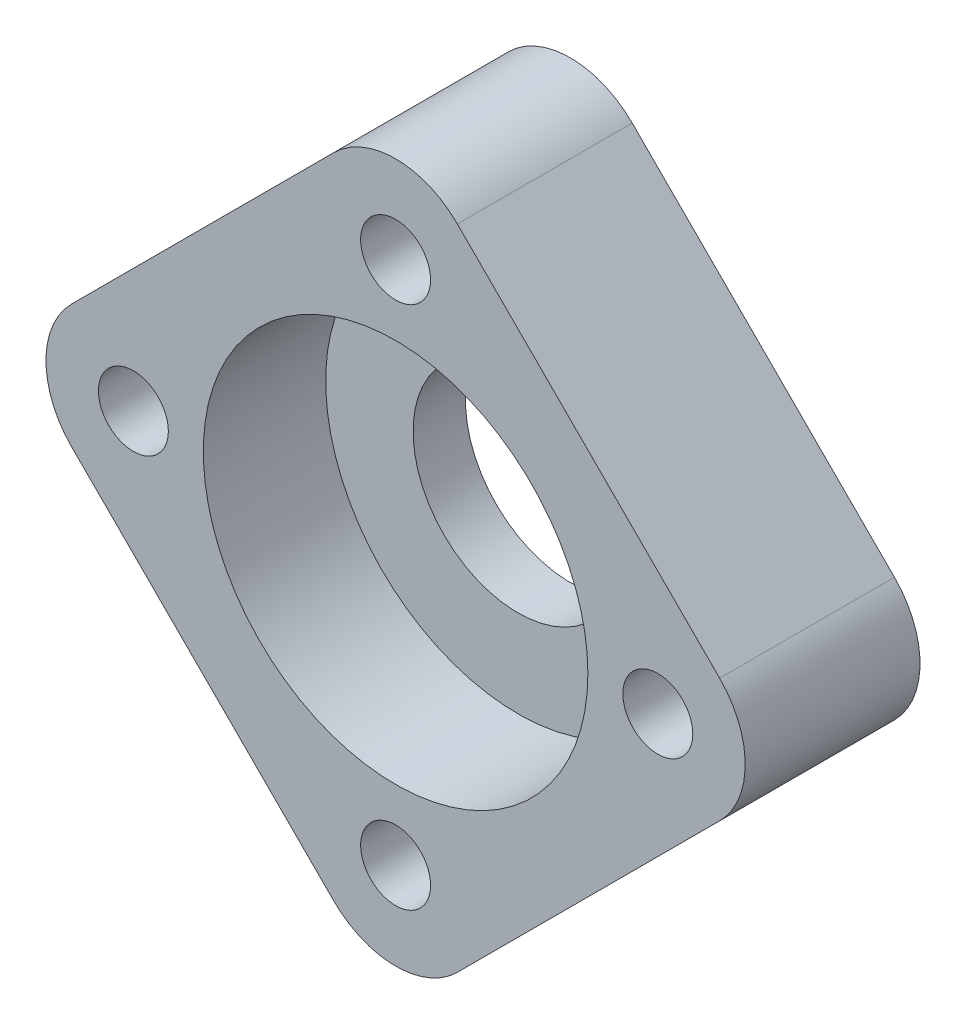
ISO-10303-21;
HEADER;
FILE_DESCRIPTION(('STEP AP214'),'2;1');
FILE_NAME('part.step','',(''),(''),'','','');
FILE_SCHEMA(('AUTOMOTIVE_DESIGN { 1 0 10303 214 1 1 1 1 }'));
ENDSEC;
DATA;
#1=APPLICATION_CONTEXT('core data for automotive mechanical design processes');
#2=APPLICATION_PROTOCOL_DEFINITION('international standard','automotive_design',2000,#1);
#3=PRODUCT_CONTEXT('',#1,'mechanical');
#4=PRODUCT('Part','Part','',(#3));
#5=PRODUCT_RELATED_PRODUCT_CATEGORY('part','',(#4));
#6=PRODUCT_DEFINITION_FORMATION('','',#4);
#7=PRODUCT_DEFINITION_CONTEXT('part definition',#1,'design');
#8=PRODUCT_DEFINITION('design','',#6,#7);
#9=PRODUCT_DEFINITION_SHAPE('','',#8);
#10=(LENGTH_UNIT() NAMED_UNIT(*) SI_UNIT(.MILLI.,.METRE.));
#11=(NAMED_UNIT(*) PLANE_ANGLE_UNIT() SI_UNIT($,.RADIAN.));
#12=(NAMED_UNIT(*) SI_UNIT($,.STERADIAN.) SOLID_ANGLE_UNIT());
#13=UNCERTAINTY_MEASURE_WITH_UNIT(LENGTH_MEASURE(1.E-05),#10,'distance_accuracy_value','');
#14=(GEOMETRIC_REPRESENTATION_CONTEXT(3) GLOBAL_UNCERTAINTY_ASSIGNED_CONTEXT((#13)) GLOBAL_UNIT_ASSIGNED_CONTEXT((#10,
#11,#12)) REPRESENTATION_CONTEXT('',''));
#15=CARTESIAN_POINT('',(0.,0.,0.));
#16=DIRECTION('',(0.,0.,1.));
#17=DIRECTION('',(1.,0.,0.));
#18=AXIS2_PLACEMENT_3D('',#15,#16,#17);
#19=CARTESIAN_POINT('',(15.,0.,10.));
#20=DIRECTION('',(0.,0.,1.));
#21=DIRECTION('',(1.,0.,0.));
#22=AXIS2_PLACEMENT_3D('',#19,#20,#21);
#23=PLANE('',#22);
#24=CARTESIAN_POINT('',(0.,0.,10.));
#25=DIRECTION('',(0.,0.,1.));
#26=DIRECTION('',(1.,0.,0.));
#27=AXIS2_PLACEMENT_3D('',#24,#25,#26);
#28=CIRCLE('',#27,11.);
#29=CARTESIAN_POINT('',(11.,0.,10.));
#30=VERTEX_POINT('',#29);
#31=EDGE_CURVE('E222',#30,#30,#28,.T.);
#32=ORIENTED_EDGE('',*,*,#31,.F.);
#33=EDGE_LOOP('',(#32));
#34=FACE_BOUND('',#33,.T.);
#35=CARTESIAN_POINT('',(0.,-15.,10.));
#36=DIRECTION('',(0.,0.,1.));
#37=DIRECTION('',(1.,0.,0.));
#38=AXIS2_PLACEMENT_3D('',#35,#36,#37);
#39=CIRCLE('',#38,2.00000000000011);
#40=CARTESIAN_POINT('',(2.00000000000012,-15.,10.));
#41=VERTEX_POINT('',#40);
#42=EDGE_CURVE('E207',#41,#41,#39,.T.);
#43=ORIENTED_EDGE('',*,*,#42,.F.);
#44=EDGE_LOOP('',(#43));
#45=FACE_BOUND('',#44,.T.);
#46=CARTESIAN_POINT('',(0.,15.,10.));
#47=DIRECTION('',(0.,0.,1.));
#48=DIRECTION('',(1.,0.,0.));
#49=AXIS2_PLACEMENT_3D('',#46,#47,#48);
#50=CIRCLE('',#49,2.);
#51=CARTESIAN_POINT('',(2.,15.,10.));
#52=VERTEX_POINT('',#51);
#53=EDGE_CURVE('E152',#52,#52,#50,.T.);
#54=ORIENTED_EDGE('',*,*,#53,.F.);
#55=EDGE_LOOP('',(#54));
#56=FACE_BOUND('',#55,.T.);
#57=CARTESIAN_POINT('',(15.,0.,10.));
#58=DIRECTION('',(0.,0.,1.));
#59=DIRECTION('',(1.,0.,0.));
#60=AXIS2_PLACEMENT_3D('',#57,#58,#59);
#61=CIRCLE('',#60,5.);
#62=CARTESIAN_POINT('',(18.5355339059327,-3.53553390593274,10.));
#63=VERTEX_POINT('',#62);
#64=CARTESIAN_POINT('',(18.5355339059327,3.53553390593274,10.));
#65=VERTEX_POINT('',#64);
#66=EDGE_CURVE('E163',#63,#65,#61,.T.);
#67=ORIENTED_EDGE('',*,*,#66,.T.);
#68=DIRECTION('',(-0.707106781186548,0.707106781186547,0.));
#69=VECTOR('',#68,1.);
#70=CARTESIAN_POINT('',(3.53553390593273,18.5355339059327,10.));
#71=LINE('',#70,#69);
#72=CARTESIAN_POINT('',(3.53553390593273,18.5355339059327,10.));
#73=VERTEX_POINT('',#72);
#74=EDGE_CURVE('E111',#65,#73,#71,.T.);
#75=ORIENTED_EDGE('',*,*,#74,.T.);
#76=CARTESIAN_POINT('',(0.,15.,10.));
#77=DIRECTION('',(0.,0.,1.));
#78=DIRECTION('',(1.,0.,0.));
#79=AXIS2_PLACEMENT_3D('',#76,#77,#78);
#80=CIRCLE('',#79,4.99999999999999);
#81=CARTESIAN_POINT('',(-3.53553390593273,18.5355339059327,10.));
#82=VERTEX_POINT('',#81);
#83=EDGE_CURVE('E179',#73,#82,#80,.T.);
#84=ORIENTED_EDGE('',*,*,#83,.T.);
#85=DIRECTION('',(-0.707106781186548,-0.707106781186547,0.));
#86=VECTOR('',#85,1.);
#87=CARTESIAN_POINT('',(-18.5355339059327,3.53553390593273,10.));
#88=LINE('',#87,#86);
#89=CARTESIAN_POINT('',(-18.5355339059327,3.53553390593273,10.));
#90=VERTEX_POINT('',#89);
#91=EDGE_CURVE('E192',#82,#90,#88,.T.);
#92=ORIENTED_EDGE('',*,*,#91,.T.);
#93=CARTESIAN_POINT('',(-15.,0.,10.));
#94=DIRECTION('',(0.,0.,1.));
#95=DIRECTION('',(1.,0.,0.));
#96=AXIS2_PLACEMENT_3D('',#93,#94,#95);
#97=CIRCLE('',#96,4.99999999999999);
#98=CARTESIAN_POINT('',(-18.5355339059327,-3.53553390593274,10.));
#99=VERTEX_POINT('',#98);
#100=EDGE_CURVE('E130',#90,#99,#97,.T.);
#101=ORIENTED_EDGE('',*,*,#100,.T.);
#102=DIRECTION('',(0.707106781186547,-0.707106781186548,0.));
#103=VECTOR('',#102,1.);
#104=CARTESIAN_POINT('',(-3.53553390593274,-18.5355339059327,10.));
#105=LINE('',#104,#103);
#106=CARTESIAN_POINT('',(-3.53553390593274,-18.5355339059327,10.));
#107=VERTEX_POINT('',#106);
#108=EDGE_CURVE('E124',#99,#107,#105,.T.);
#109=ORIENTED_EDGE('',*,*,#108,.T.);
#110=CARTESIAN_POINT('',(0.,-15.,10.));
#111=DIRECTION('',(0.,0.,1.));
#112=DIRECTION('',(1.,0.,0.));
#113=AXIS2_PLACEMENT_3D('',#110,#111,#112);
#114=CIRCLE('',#113,5.);
#115=CARTESIAN_POINT('',(3.53553390593274,-18.5355339059327,10.));
#116=VERTEX_POINT('',#115);
#117=EDGE_CURVE('E128',#107,#116,#114,.T.);
#118=ORIENTED_EDGE('',*,*,#117,.T.);
#119=DIRECTION('',(0.707106781186547,0.707106781186547,0.));
#120=VECTOR('',#119,1.);
#121=CARTESIAN_POINT('',(18.5355339059327,-3.53553390593274,10.));
#122=LINE('',#121,#120);
#123=EDGE_CURVE('E68',#116,#63,#122,.T.);
#124=ORIENTED_EDGE('',*,*,#123,.T.);
#125=EDGE_LOOP('',(#67,#75,#84,#92,#101,#109,#118,#124));
#126=FACE_BOUND('',#125,.T.);
#127=CARTESIAN_POINT('',(15.,0.,10.));
#128=DIRECTION('',(0.,0.,1.));
#129=DIRECTION('',(1.,0.,0.));
#130=AXIS2_PLACEMENT_3D('',#127,#128,#129);
#131=CIRCLE('',#130,2.00000000000004);
#132=CARTESIAN_POINT('',(17.,0.,10.));
#133=VERTEX_POINT('',#132);
#134=EDGE_CURVE('E201',#133,#133,#131,.T.);
#135=ORIENTED_EDGE('',*,*,#134,.F.);
#136=EDGE_LOOP('',(#135));
#137=FACE_BOUND('',#136,.T.);
#138=CARTESIAN_POINT('',(-15.,0.,10.));
#139=DIRECTION('',(0.,0.,1.));
#140=DIRECTION('',(1.,0.,0.));
#141=AXIS2_PLACEMENT_3D('',#138,#139,#140);
#142=CIRCLE('',#141,2.00000000000015);
#143=CARTESIAN_POINT('',(-12.9999999999999,0.,10.));
#144=VERTEX_POINT('',#143);
#145=EDGE_CURVE('E213',#144,#144,#142,.T.);
#146=ORIENTED_EDGE('',*,*,#145,.F.);
#147=EDGE_LOOP('',(#146));
#148=FACE_BOUND('',#147,.T.);
#149=ADVANCED_FACE('F50',(#34,#45,#56,#126,#137,#148),#23,.T.);
#150=CARTESIAN_POINT('',(15.,0.,0.));
#151=DIRECTION('',(0.,0.,1.));
#152=DIRECTION('',(1.,0.,0.));
#153=AXIS2_PLACEMENT_3D('',#150,#151,#152);
#154=PLANE('',#153);
#155=CARTESIAN_POINT('',(0.,0.,0.));
#156=DIRECTION('',(0.,0.,1.));
#157=DIRECTION('',(1.,0.,0.));
#158=AXIS2_PLACEMENT_3D('',#155,#156,#157);
#159=CIRCLE('',#158,6.);
#160=CARTESIAN_POINT('',(6.,0.,0.));
#161=VERTEX_POINT('',#160);
#162=EDGE_CURVE('E54',#161,#161,#159,.T.);
#163=ORIENTED_EDGE('',*,*,#162,.T.);
#164=EDGE_LOOP('',(#163));
#165=FACE_BOUND('',#164,.T.);
#166=CARTESIAN_POINT('',(15.,0.,0.));
#167=DIRECTION('',(0.,0.,1.));
#168=DIRECTION('',(1.,0.,0.));
#169=AXIS2_PLACEMENT_3D('',#166,#167,#168);
#170=CIRCLE('',#169,5.);
#171=CARTESIAN_POINT('',(18.5355339059327,-3.53553390593274,0.));
#172=VERTEX_POINT('',#171);
#173=CARTESIAN_POINT('',(18.5355339059327,3.53553390593274,0.));
#174=VERTEX_POINT('',#173);
#175=EDGE_CURVE('E148',#172,#174,#170,.T.);
#176=ORIENTED_EDGE('',*,*,#175,.F.);
#177=DIRECTION('',(0.707106781186547,0.707106781186547,0.));
#178=VECTOR('',#177,1.);
#179=CARTESIAN_POINT('',(18.5355339059327,-3.53553390593274,0.));
#180=LINE('',#179,#178);
#181=CARTESIAN_POINT('',(3.53553390593274,-18.5355339059327,0.));
#182=VERTEX_POINT('',#181);
#183=EDGE_CURVE('E103',#182,#172,#180,.T.);
#184=ORIENTED_EDGE('',*,*,#183,.F.);
#185=CARTESIAN_POINT('',(0.,-15.,0.));
#186=DIRECTION('',(0.,0.,1.));
#187=DIRECTION('',(1.,0.,0.));
#188=AXIS2_PLACEMENT_3D('',#185,#186,#187);
#189=CIRCLE('',#188,5.);
#190=CARTESIAN_POINT('',(-3.53553390593274,-18.5355339059327,0.));
#191=VERTEX_POINT('',#190);
#192=EDGE_CURVE('E97',#191,#182,#189,.T.);
#193=ORIENTED_EDGE('',*,*,#192,.F.);
#194=DIRECTION('',(0.707106781186547,-0.707106781186548,0.));
#195=VECTOR('',#194,1.);
#196=CARTESIAN_POINT('',(-3.53553390593274,-18.5355339059327,0.));
#197=LINE('',#196,#195);
#198=CARTESIAN_POINT('',(-18.5355339059327,-3.53553390593274,0.));
#199=VERTEX_POINT('',#198);
#200=EDGE_CURVE('E138',#199,#191,#197,.T.);
#201=ORIENTED_EDGE('',*,*,#200,.F.);
#202=CARTESIAN_POINT('',(-15.,0.,0.));
#203=DIRECTION('',(0.,0.,1.));
#204=DIRECTION('',(1.,0.,0.));
#205=AXIS2_PLACEMENT_3D('',#202,#203,#204);
#206=CIRCLE('',#205,4.99999999999999);
#207=CARTESIAN_POINT('',(-18.5355339059327,3.53553390593273,0.));
#208=VERTEX_POINT('',#207);
#209=EDGE_CURVE('E158',#208,#199,#206,.T.);
#210=ORIENTED_EDGE('',*,*,#209,.F.);
#211=DIRECTION('',(-0.707106781186548,-0.707106781186547,0.));
#212=VECTOR('',#211,1.);
#213=CARTESIAN_POINT('',(-18.5355339059327,3.53553390593273,0.));
#214=LINE('',#213,#212);
#215=CARTESIAN_POINT('',(-3.53553390593273,18.5355339059327,0.));
#216=VERTEX_POINT('',#215);
#217=EDGE_CURVE('E156',#216,#208,#214,.T.);
#218=ORIENTED_EDGE('',*,*,#217,.F.);
#219=CARTESIAN_POINT('',(0.,15.,0.));
#220=DIRECTION('',(0.,0.,1.));
#221=DIRECTION('',(1.,0.,0.));
#222=AXIS2_PLACEMENT_3D('',#219,#220,#221);
#223=CIRCLE('',#222,4.99999999999999);
#224=CARTESIAN_POINT('',(3.53553390593273,18.5355339059327,0.));
#225=VERTEX_POINT('',#224);
#226=EDGE_CURVE('E154',#225,#216,#223,.T.);
#227=ORIENTED_EDGE('',*,*,#226,.F.);
#228=DIRECTION('',(-0.707106781186548,0.707106781186547,0.));
#229=VECTOR('',#228,1.);
#230=CARTESIAN_POINT('',(3.53553390593273,18.5355339059327,0.));
#231=LINE('',#230,#229);
#232=EDGE_CURVE('E151',#174,#225,#231,.T.);
#233=ORIENTED_EDGE('',*,*,#232,.F.);
#234=EDGE_LOOP('',(#176,#184,#193,#201,#210,#218,#227,#233));
#235=FACE_BOUND('',#234,.T.);
#236=CARTESIAN_POINT('',(0.,15.,0.));
#237=DIRECTION('',(0.,0.,1.));
#238=DIRECTION('',(1.,0.,0.));
#239=AXIS2_PLACEMENT_3D('',#236,#237,#238);
#240=CIRCLE('',#239,2.);
#241=CARTESIAN_POINT('',(2.,15.,0.));
#242=VERTEX_POINT('',#241);
#243=EDGE_CURVE('E198',#242,#242,#240,.T.);
#244=ORIENTED_EDGE('',*,*,#243,.T.);
#245=EDGE_LOOP('',(#244));
#246=FACE_BOUND('',#245,.T.);
#247=CARTESIAN_POINT('',(15.,0.,0.));
#248=DIRECTION('',(0.,0.,1.));
#249=DIRECTION('',(1.,0.,0.));
#250=AXIS2_PLACEMENT_3D('',#247,#248,#249);
#251=CIRCLE('',#250,2.00000000000004);
#252=CARTESIAN_POINT('',(17.,0.,0.));
#253=VERTEX_POINT('',#252);
#254=EDGE_CURVE('E204',#253,#253,#251,.T.);
#255=ORIENTED_EDGE('',*,*,#254,.T.);
#256=EDGE_LOOP('',(#255));
#257=FACE_BOUND('',#256,.T.);
#258=CARTESIAN_POINT('',(0.,-15.,0.));
#259=DIRECTION('',(0.,0.,1.));
#260=DIRECTION('',(1.,0.,0.));
#261=AXIS2_PLACEMENT_3D('',#258,#259,#260);
#262=CIRCLE('',#261,2.00000000000011);
#263=CARTESIAN_POINT('',(2.00000000000012,-15.,0.));
#264=VERTEX_POINT('',#263);
#265=EDGE_CURVE('E210',#264,#264,#262,.T.);
#266=ORIENTED_EDGE('',*,*,#265,.T.);
#267=EDGE_LOOP('',(#266));
#268=FACE_BOUND('',#267,.T.);
#269=CARTESIAN_POINT('',(-15.,0.,0.));
#270=DIRECTION('',(0.,0.,1.));
#271=DIRECTION('',(1.,0.,0.));
#272=AXIS2_PLACEMENT_3D('',#269,#270,#271);
#273=CIRCLE('',#272,2.00000000000015);
#274=CARTESIAN_POINT('',(-12.9999999999999,0.,0.));
#275=VERTEX_POINT('',#274);
#276=EDGE_CURVE('E216',#275,#275,#273,.T.);
#277=ORIENTED_EDGE('',*,*,#276,.T.);
#278=EDGE_LOOP('',(#277));
#279=FACE_BOUND('',#278,.T.);
#280=ADVANCED_FACE('F183',(#165,#235,#246,#257,#268,#279),#154,.F.);
#281=CARTESIAN_POINT('',(15.,0.,10.));
#282=DIRECTION('',(0.,0.,-1.));
#283=DIRECTION('',(-1.,0.,0.));
#284=AXIS2_PLACEMENT_3D('',#281,#282,#283);
#285=CYLINDRICAL_SURFACE('',#284,5.);
#286=ORIENTED_EDGE('',*,*,#175,.T.);
#287=DIRECTION('',(0.,0.,-1.));
#288=VECTOR('',#287,1.);
#289=CARTESIAN_POINT('',(18.5355339059327,3.53553390593274,10.));
#290=LINE('',#289,#288);
#291=EDGE_CURVE('E13',#65,#174,#290,.T.);
#292=ORIENTED_EDGE('',*,*,#291,.F.);
#293=ORIENTED_EDGE('',*,*,#66,.F.);
#294=DIRECTION('',(0.,0.,-1.));
#295=VECTOR('',#294,1.);
#296=CARTESIAN_POINT('',(18.5355339059327,-3.53553390593274,10.));
#297=LINE('',#296,#295);
#298=EDGE_CURVE('E144',#63,#172,#297,.T.);
#299=ORIENTED_EDGE('',*,*,#298,.T.);
#300=EDGE_LOOP('',(#286,#292,#293,#299));
#301=FACE_BOUND('',#300,.T.);
#302=ADVANCED_FACE('F52',(#301),#285,.T.);
#303=CARTESIAN_POINT('',(3.53553390593273,18.5355339059327,10.));
#304=DIRECTION('',(-0.707106781186547,-0.707106781186548,0.));
#305=DIRECTION('',(0.707106781186548,-0.707106781186547,0.));
#306=AXIS2_PLACEMENT_3D('',#303,#304,#305);
#307=PLANE('',#306);
#308=ORIENTED_EDGE('',*,*,#232,.T.);
#309=DIRECTION('',(0.,0.,-1.));
#310=VECTOR('',#309,1.);
#311=CARTESIAN_POINT('',(3.53553390593273,18.5355339059327,10.));
#312=LINE('',#311,#310);
#313=EDGE_CURVE('E60',#73,#225,#312,.T.);
#314=ORIENTED_EDGE('',*,*,#313,.F.);
#315=ORIENTED_EDGE('',*,*,#74,.F.);
#316=ORIENTED_EDGE('',*,*,#291,.T.);
#317=EDGE_LOOP('',(#308,#314,#315,#316));
#318=FACE_BOUND('',#317,.T.);
#319=ADVANCED_FACE('F270',(#318),#307,.F.);
#320=CARTESIAN_POINT('',(0.,15.,10.));
#321=DIRECTION('',(0.,0.,-1.));
#322=DIRECTION('',(-1.,0.,0.));
#323=AXIS2_PLACEMENT_3D('',#320,#321,#322);
#324=CYLINDRICAL_SURFACE('',#323,4.99999999999999);
#325=ORIENTED_EDGE('',*,*,#226,.T.);
#326=DIRECTION('',(0.,0.,-1.));
#327=VECTOR('',#326,1.);
#328=CARTESIAN_POINT('',(-3.53553390593273,18.5355339059327,10.));
#329=LINE('',#328,#327);
#330=EDGE_CURVE('E170',#82,#216,#329,.T.);
#331=ORIENTED_EDGE('',*,*,#330,.F.);
#332=ORIENTED_EDGE('',*,*,#83,.F.);
#333=ORIENTED_EDGE('',*,*,#313,.T.);
#334=EDGE_LOOP('',(#325,#331,#332,#333));
#335=FACE_BOUND('',#334,.T.);
#336=ADVANCED_FACE('F177',(#335),#324,.T.);
#337=CARTESIAN_POINT('',(-18.5355339059327,3.53553390593273,10.));
#338=DIRECTION('',(0.707106781186547,-0.707106781186548,0.));
#339=DIRECTION('',(0.707106781186548,0.707106781186547,0.));
#340=AXIS2_PLACEMENT_3D('',#337,#338,#339);
#341=PLANE('',#340);
#342=ORIENTED_EDGE('',*,*,#217,.T.);
#343=DIRECTION('',(0.,0.,-1.));
#344=VECTOR('',#343,1.);
#345=CARTESIAN_POINT('',(-18.5355339059327,3.53553390593273,10.));
#346=LINE('',#345,#344);
#347=EDGE_CURVE('E167',#90,#208,#346,.T.);
#348=ORIENTED_EDGE('',*,*,#347,.F.);
#349=ORIENTED_EDGE('',*,*,#91,.F.);
#350=ORIENTED_EDGE('',*,*,#330,.T.);
#351=EDGE_LOOP('',(#342,#348,#349,#350));
#352=FACE_BOUND('',#351,.T.);
#353=ADVANCED_FACE('F188',(#352),#341,.F.);
#354=CARTESIAN_POINT('',(-15.,0.,10.));
#355=DIRECTION('',(0.,0.,-1.));
#356=DIRECTION('',(-1.,0.,0.));
#357=AXIS2_PLACEMENT_3D('',#354,#355,#356);
#358=CYLINDRICAL_SURFACE('',#357,4.99999999999999);
#359=ORIENTED_EDGE('',*,*,#209,.T.);
#360=DIRECTION('',(0.,0.,-1.));
#361=VECTOR('',#360,1.);
#362=CARTESIAN_POINT('',(-18.5355339059327,-3.53553390593274,10.));
#363=LINE('',#362,#361);
#364=EDGE_CURVE('E139',#99,#199,#363,.T.);
#365=ORIENTED_EDGE('',*,*,#364,.F.);
#366=ORIENTED_EDGE('',*,*,#100,.F.);
#367=ORIENTED_EDGE('',*,*,#347,.T.);
#368=EDGE_LOOP('',(#359,#365,#366,#367));
#369=FACE_BOUND('',#368,.T.);
#370=ADVANCED_FACE('F191',(#369),#358,.T.);
#371=CARTESIAN_POINT('',(-3.53553390593274,-18.5355339059327,10.));
#372=DIRECTION('',(0.707106781186548,0.707106781186547,0.));
#373=DIRECTION('',(-0.707106781186547,0.707106781186548,0.));
#374=AXIS2_PLACEMENT_3D('',#371,#372,#373);
#375=PLANE('',#374);
#376=ORIENTED_EDGE('',*,*,#200,.T.);
#377=DIRECTION('',(0.,0.,-1.));
#378=VECTOR('',#377,1.);
#379=CARTESIAN_POINT('',(-3.53553390593274,-18.5355339059327,10.));
#380=LINE('',#379,#378);
#381=EDGE_CURVE('E135',#107,#191,#380,.T.);
#382=ORIENTED_EDGE('',*,*,#381,.F.);
#383=ORIENTED_EDGE('',*,*,#108,.F.);
#384=ORIENTED_EDGE('',*,*,#364,.T.);
#385=EDGE_LOOP('',(#376,#382,#383,#384));
#386=FACE_BOUND('',#385,.T.);
#387=ADVANCED_FACE('F136',(#386),#375,.F.);
#388=CARTESIAN_POINT('',(0.,-15.,10.));
#389=DIRECTION('',(0.,0.,-1.));
#390=DIRECTION('',(-1.,0.,0.));
#391=AXIS2_PLACEMENT_3D('',#388,#389,#390);
#392=CYLINDRICAL_SURFACE('',#391,5.);
#393=ORIENTED_EDGE('',*,*,#192,.T.);
#394=DIRECTION('',(0.,0.,-1.));
#395=VECTOR('',#394,1.);
#396=CARTESIAN_POINT('',(3.53553390593274,-18.5355339059327,10.));
#397=LINE('',#396,#395);
#398=EDGE_CURVE('E140',#116,#182,#397,.T.);
#399=ORIENTED_EDGE('',*,*,#398,.F.);
#400=ORIENTED_EDGE('',*,*,#117,.F.);
#401=ORIENTED_EDGE('',*,*,#381,.T.);
#402=EDGE_LOOP('',(#393,#399,#400,#401));
#403=FACE_BOUND('',#402,.T.);
#404=ADVANCED_FACE('F142',(#403),#392,.T.);
#405=CARTESIAN_POINT('',(18.5355339059327,-3.53553390593274,10.));
#406=DIRECTION('',(-0.707106781186548,0.707106781186548,0.));
#407=DIRECTION('',(-0.707106781186548,-0.707106781186548,0.));
#408=AXIS2_PLACEMENT_3D('',#405,#406,#407);
#409=PLANE('',#408);
#410=ORIENTED_EDGE('',*,*,#183,.T.);
#411=ORIENTED_EDGE('',*,*,#298,.F.);
#412=ORIENTED_EDGE('',*,*,#123,.F.);
#413=ORIENTED_EDGE('',*,*,#398,.T.);
#414=EDGE_LOOP('',(#410,#411,#412,#413));
#415=FACE_BOUND('',#414,.T.);
#416=ADVANCED_FACE('F258',(#415),#409,.F.);
#417=CARTESIAN_POINT('',(0.,15.,10.));
#418=DIRECTION('',(0.,0.,-1.));
#419=DIRECTION('',(-1.,0.,0.));
#420=AXIS2_PLACEMENT_3D('',#417,#418,#419);
#421=CYLINDRICAL_SURFACE('',#420,2.);
#422=ORIENTED_EDGE('',*,*,#53,.T.);
#423=EDGE_LOOP('',(#422));
#424=FACE_BOUND('',#423,.T.);
#425=ORIENTED_EDGE('',*,*,#243,.F.);
#426=EDGE_LOOP('',(#425));
#427=FACE_BOUND('',#426,.T.);
#428=ADVANCED_FACE('F255',(#424,#427),#421,.F.);
#429=CARTESIAN_POINT('',(15.,0.,10.));
#430=DIRECTION('',(0.,0.,-1.));
#431=DIRECTION('',(-1.,0.,0.));
#432=AXIS2_PLACEMENT_3D('',#429,#430,#431);
#433=CYLINDRICAL_SURFACE('',#432,2.00000000000004);
#434=ORIENTED_EDGE('',*,*,#134,.T.);
#435=EDGE_LOOP('',(#434));
#436=FACE_BOUND('',#435,.T.);
#437=ORIENTED_EDGE('',*,*,#254,.F.);
#438=EDGE_LOOP('',(#437));
#439=FACE_BOUND('',#438,.T.);
#440=ADVANCED_FACE('F330',(#436,#439),#433,.F.);
#441=CARTESIAN_POINT('',(0.,-15.,10.));
#442=DIRECTION('',(0.,0.,-1.));
#443=DIRECTION('',(-1.,0.,0.));
#444=AXIS2_PLACEMENT_3D('',#441,#442,#443);
#445=CYLINDRICAL_SURFACE('',#444,2.00000000000011);
#446=ORIENTED_EDGE('',*,*,#42,.T.);
#447=EDGE_LOOP('',(#446));
#448=FACE_BOUND('',#447,.T.);
#449=ORIENTED_EDGE('',*,*,#265,.F.);
#450=EDGE_LOOP('',(#449));
#451=FACE_BOUND('',#450,.T.);
#452=ADVANCED_FACE('F320',(#448,#451),#445,.F.);
#453=CARTESIAN_POINT('',(-15.,0.,10.));
#454=DIRECTION('',(0.,0.,-1.));
#455=DIRECTION('',(-1.,0.,0.));
#456=AXIS2_PLACEMENT_3D('',#453,#454,#455);
#457=CYLINDRICAL_SURFACE('',#456,2.00000000000015);
#458=ORIENTED_EDGE('',*,*,#145,.T.);
#459=EDGE_LOOP('',(#458));
#460=FACE_BOUND('',#459,.T.);
#461=ORIENTED_EDGE('',*,*,#276,.F.);
#462=EDGE_LOOP('',(#461));
#463=FACE_BOUND('',#462,.T.);
#464=ADVANCED_FACE('F311',(#460,#463),#457,.F.);
#465=CARTESIAN_POINT('',(0.,0.,3.));
#466=DIRECTION('',(0.,0.,1.));
#467=DIRECTION('',(1.,0.,0.));
#468=AXIS2_PLACEMENT_3D('',#465,#466,#467);
#469=CYLINDRICAL_SURFACE('',#468,11.);
#470=CARTESIAN_POINT('',(0.,0.,3.));
#471=DIRECTION('',(0.,0.,1.));
#472=DIRECTION('',(1.,0.,0.));
#473=AXIS2_PLACEMENT_3D('',#470,#471,#472);
#474=CIRCLE('',#473,11.);
#475=CARTESIAN_POINT('',(11.,0.,3.));
#476=VERTEX_POINT('',#475);
#477=EDGE_CURVE('E219',#476,#476,#474,.T.);
#478=ORIENTED_EDGE('',*,*,#477,.F.);
#479=EDGE_LOOP('',(#478));
#480=FACE_BOUND('',#479,.T.);
#481=ORIENTED_EDGE('',*,*,#31,.T.);
#482=EDGE_LOOP('',(#481));
#483=FACE_BOUND('',#482,.T.);
#484=ADVANCED_FACE('F242',(#480,#483),#469,.F.);
#485=CARTESIAN_POINT('',(0.,0.,3.));
#486=DIRECTION('',(0.,0.,1.));
#487=DIRECTION('',(1.,0.,0.));
#488=AXIS2_PLACEMENT_3D('',#485,#486,#487);
#489=PLANE('',#488);
#490=CARTESIAN_POINT('',(0.,0.,3.));
#491=DIRECTION('',(0.,0.,1.));
#492=DIRECTION('',(1.,0.,0.));
#493=AXIS2_PLACEMENT_3D('',#490,#491,#492);
#494=CIRCLE('',#493,6.);
#495=CARTESIAN_POINT('',(6.,0.,3.));
#496=VERTEX_POINT('',#495);
#497=EDGE_CURVE('E227',#496,#496,#494,.T.);
#498=ORIENTED_EDGE('',*,*,#497,.F.);
#499=EDGE_LOOP('',(#498));
#500=FACE_BOUND('',#499,.T.);
#501=ORIENTED_EDGE('',*,*,#477,.T.);
#502=EDGE_LOOP('',(#501));
#503=FACE_BOUND('',#502,.T.);
#504=ADVANCED_FACE('F237',(#500,#503),#489,.T.);
#505=CARTESIAN_POINT('',(0.,0.,-4.));
#506=DIRECTION('',(0.,0.,1.));
#507=DIRECTION('',(1.,0.,0.));
#508=AXIS2_PLACEMENT_3D('',#505,#506,#507);
#509=CYLINDRICAL_SURFACE('',#508,6.);
#510=ORIENTED_EDGE('',*,*,#497,.T.);
#511=EDGE_LOOP('',(#510));
#512=FACE_BOUND('',#511,.T.);
#513=ORIENTED_EDGE('',*,*,#162,.F.);
#514=EDGE_LOOP('',(#513));
#515=FACE_BOUND('',#514,.T.);
#516=ADVANCED_FACE('F235',(#512,#515),#509,.F.);
#517=CLOSED_SHELL('',(#149,#280,#302,#319,#336,#353,#370,#387,#404,#416,#428,#440,#452,#464,
#484,#504,#516));
#518=MANIFOLD_SOLID_BREP('B2',#517);
#519=ADVANCED_BREP_SHAPE_REPRESENTATION('',(#18,#518),#14);
#520=SHAPE_DEFINITION_REPRESENTATION(#9,#519);
ENDSEC;
END-ISO-10303-21;
